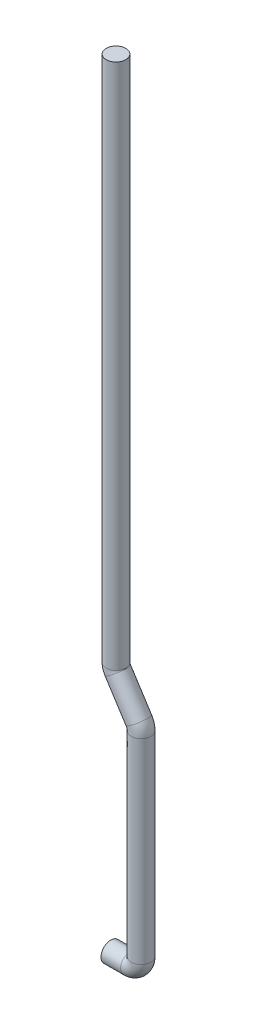
ISO-10303-21;
HEADER;
FILE_DESCRIPTION(('STEP AP214'),'2;1');
FILE_NAME('part.step','',(''),(''),'','','');
FILE_SCHEMA(('AUTOMOTIVE_DESIGN { 1 0 10303 214 1 1 1 1 }'));
ENDSEC;
DATA;
#1=APPLICATION_CONTEXT('core data for automotive mechanical design processes');
#2=APPLICATION_PROTOCOL_DEFINITION('international standard','automotive_design',2000,#1);
#3=PRODUCT_CONTEXT('',#1,'mechanical');
#4=PRODUCT('Part','Part','',(#3));
#5=PRODUCT_RELATED_PRODUCT_CATEGORY('part','',(#4));
#6=PRODUCT_DEFINITION_FORMATION('','',#4);
#7=PRODUCT_DEFINITION_CONTEXT('part definition',#1,'design');
#8=PRODUCT_DEFINITION('design','',#6,#7);
#9=PRODUCT_DEFINITION_SHAPE('','',#8);
#10=(LENGTH_UNIT() NAMED_UNIT(*) SI_UNIT(.MILLI.,.METRE.));
#11=(NAMED_UNIT(*) PLANE_ANGLE_UNIT() SI_UNIT($,.RADIAN.));
#12=(NAMED_UNIT(*) SI_UNIT($,.STERADIAN.) SOLID_ANGLE_UNIT());
#13=UNCERTAINTY_MEASURE_WITH_UNIT(LENGTH_MEASURE(1.E-05),#10,'distance_accuracy_value','');
#14=(GEOMETRIC_REPRESENTATION_CONTEXT(3) GLOBAL_UNCERTAINTY_ASSIGNED_CONTEXT((#13)) GLOBAL_UNIT_ASSIGNED_CONTEXT((#10,
#11,#12)) REPRESENTATION_CONTEXT('',''));
#15=CARTESIAN_POINT('',(0.,0.,0.));
#16=DIRECTION('',(0.,0.,1.));
#17=DIRECTION('',(1.,0.,0.));
#18=AXIS2_PLACEMENT_3D('',#15,#16,#17);
#19=CARTESIAN_POINT('',(2.11214781096203,317.721722854031,0.));
#20=DIRECTION('',(0.,1.,0.));
#21=DIRECTION('',(0.,0.,-1.));
#22=AXIS2_PLACEMENT_3D('',#19,#20,#21);
#23=PLANE('',#22);
#24=CARTESIAN_POINT('',(2.11214781096203,317.721722854031,0.));
#25=DIRECTION('',(0.,1.,0.));
#26=DIRECTION('',(0.,0.,-1.));
#27=AXIS2_PLACEMENT_3D('',#24,#25,#26);
#28=CIRCLE('',#27,4.);
#29=CARTESIAN_POINT('',(2.11214781096203,317.721722854031,-4.));
#30=VERTEX_POINT('',#29);
#31=EDGE_CURVE('E82',#30,#30,#28,.T.);
#32=ORIENTED_EDGE('',*,*,#31,.T.);
#33=EDGE_LOOP('',(#32));
#34=FACE_BOUND('',#33,.T.);
#35=ADVANCED_FACE('F47',(#34),#23,.T.);
#36=CARTESIAN_POINT('',(0.,0.,0.));
#37=DIRECTION('',(1.,0.,0.));
#38=DIRECTION('',(0.,0.,-1.));
#39=AXIS2_PLACEMENT_3D('',#36,#37,#38);
#40=PLANE('',#39);
#41=CARTESIAN_POINT('',(0.,0.,0.));
#42=DIRECTION('',(1.,0.,0.));
#43=DIRECTION('',(0.,0.,-1.));
#44=AXIS2_PLACEMENT_3D('',#41,#42,#43);
#45=CIRCLE('',#44,4.);
#46=CARTESIAN_POINT('',(0.,0.,-4.));
#47=VERTEX_POINT('',#46);
#48=EDGE_CURVE('E12',#47,#47,#45,.T.);
#49=ORIENTED_EDGE('',*,*,#48,.F.);
#50=EDGE_LOOP('',(#49));
#51=FACE_BOUND('',#50,.T.);
#52=ADVANCED_FACE('F91',(#51),#40,.F.);
#53=CARTESIAN_POINT('',(2.11214781096203,317.721722854031,0.));
#54=DIRECTION('',(0.,-1.,0.));
#55=DIRECTION('',(1.,0.,0.));
#56=AXIS2_PLACEMENT_3D('',#53,#54,#55);
#57=CYLINDRICAL_SURFACE('',#56,4.);
#58=CARTESIAN_POINT('',(2.11214781096205,103.015358085818,0.));
#59=DIRECTION('',(0.,1.,0.));
#60=DIRECTION('',(0.,0.,-1.));
#61=AXIS2_PLACEMENT_3D('',#58,#59,#60);
#62=CIRCLE('',#61,4.);
#63=CARTESIAN_POINT('',(-1.88785218903794,103.015358085818,0.));
#64=VERTEX_POINT('',#63);
#65=EDGE_CURVE('E78',#64,#64,#62,.T.);
#66=ORIENTED_EDGE('',*,*,#65,.T.);
#67=EDGE_LOOP('',(#66));
#68=FACE_BOUND('',#67,.T.);
#69=ORIENTED_EDGE('',*,*,#31,.F.);
#70=EDGE_LOOP('',(#69));
#71=FACE_BOUND('',#70,.T.);
#72=ADVANCED_FACE('F88',(#68,#71),#57,.T.);
#73=CARTESIAN_POINT('',(6.46266725096206,103.015358085818,0.));
#74=DIRECTION('',(0.,0.,1.));
#75=DIRECTION('',(1.,0.,0.));
#76=AXIS2_PLACEMENT_3D('',#73,#74,#75);
#77=TOROIDAL_SURFACE('',#76,4.35051944,4.);
#78=CARTESIAN_POINT('',(2.80307598330831,100.6628251633,0.));
#79=DIRECTION('',(-0.540747594617767,0.841184901739861,0.));
#80=DIRECTION('',(0.,0.,-1.));
#81=AXIS2_PLACEMENT_3D('',#78,#79,#80);
#82=CIRCLE('',#81,4.);
#83=CARTESIAN_POINT('',(-0.561663623651139,98.4998347848288,0.));
#84=VERTEX_POINT('',#83);
#85=EDGE_CURVE('E74',#84,#84,#82,.T.);
#86=CARTESIAN_POINT('',(6.46266725096206,103.015358085818,0.));
#87=DIRECTION('',(0.,0.,1.));
#88=DIRECTION('',(1.,0.,0.));
#89=AXIS2_PLACEMENT_3D('',#86,#87,#88);
#90=CIRCLE('',#89,8.35051944);
#91=EDGE_CURVE('',#64,#84,#90,.T.);
#92=ORIENTED_EDGE('',*,*,#65,.F.);
#93=ORIENTED_EDGE('',*,*,#85,.T.);
#94=ORIENTED_EDGE('',*,*,#91,.T.);
#95=ORIENTED_EDGE('',*,*,#91,.F.);
#96=EDGE_LOOP('',(#92,#94,#93,#95));
#97=FACE_BOUND('',#96,.T.);
#98=ADVANCED_FACE('F90',(#97),#77,.T.);
#99=CARTESIAN_POINT('',(2.80307598330831,100.6628251633,0.));
#100=DIRECTION('',(0.540747594617768,-0.84118490173986,0.));
#101=DIRECTION('',(0.84118490173986,0.540747594617768,0.));
#102=AXIS2_PLACEMENT_3D('',#99,#100,#101);
#103=CYLINDRICAL_SURFACE('',#102,4.);
#104=CARTESIAN_POINT('',(11.3883564338094,87.3075955440749,0.));
#105=DIRECTION('',(-0.540747594617768,0.84118490173986,0.));
#106=DIRECTION('',(0.,0.,-1.));
#107=AXIS2_PLACEMENT_3D('',#104,#105,#106);
#108=CIRCLE('',#107,4.);
#109=CARTESIAN_POINT('',(14.7530960407688,89.470585922546,0.));
#110=VERTEX_POINT('',#109);
#111=EDGE_CURVE('E70',#110,#110,#108,.T.);
#112=ORIENTED_EDGE('',*,*,#111,.T.);
#113=EDGE_LOOP('',(#112));
#114=FACE_BOUND('',#113,.T.);
#115=ORIENTED_EDGE('',*,*,#85,.F.);
#116=EDGE_LOOP('',(#115));
#117=FACE_BOUND('',#116,.T.);
#118=ADVANCED_FACE('F98',(#114,#117),#103,.T.);
#119=CARTESIAN_POINT('',(6.29213446549112,84.0315384425905,0.));
#120=DIRECTION('',(0.,0.,-1.));
#121=DIRECTION('',(-1.,0.,0.));
#122=AXIS2_PLACEMENT_3D('',#119,#120,#121);
#123=TOROIDAL_SURFACE('',#122,6.05838497312246,4.);
#124=CARTESIAN_POINT('',(12.3505194386136,84.0315384425905,0.));
#125=DIRECTION('',(0.,1.,0.));
#126=DIRECTION('',(0.,0.,-1.));
#127=AXIS2_PLACEMENT_3D('',#124,#125,#126);
#128=CIRCLE('',#127,4.);
#129=CARTESIAN_POINT('',(16.3505194386136,84.0315384425905,0.));
#130=VERTEX_POINT('',#129);
#131=EDGE_CURVE('E64',#130,#130,#128,.T.);
#132=CARTESIAN_POINT('',(6.29213446549112,84.0315384425905,0.));
#133=DIRECTION('',(0.,0.,-1.));
#134=DIRECTION('',(-1.,0.,0.));
#135=AXIS2_PLACEMENT_3D('',#132,#133,#134);
#136=CIRCLE('',#135,10.0583849731225);
#137=EDGE_CURVE('',#110,#130,#136,.T.);
#138=ORIENTED_EDGE('',*,*,#111,.F.);
#139=ORIENTED_EDGE('',*,*,#131,.T.);
#140=ORIENTED_EDGE('',*,*,#137,.T.);
#141=ORIENTED_EDGE('',*,*,#137,.F.);
#142=EDGE_LOOP('',(#138,#140,#139,#141));
#143=FACE_BOUND('',#142,.T.);
#144=ADVANCED_FACE('F115',(#143),#123,.T.);
#145=CARTESIAN_POINT('',(12.3505194386136,84.0315384425905,0.));
#146=DIRECTION('',(0.,-1.,0.));
#147=DIRECTION('',(1.,0.,0.));
#148=AXIS2_PLACEMENT_3D('',#145,#146,#147);
#149=CYLINDRICAL_SURFACE('',#148,4.);
#150=CARTESIAN_POINT('',(12.3505194386136,4.35051943861358,0.));
#151=DIRECTION('',(0.,1.,0.));
#152=DIRECTION('',(0.,0.,-1.));
#153=AXIS2_PLACEMENT_3D('',#150,#151,#152);
#154=CIRCLE('',#153,4.);
#155=CARTESIAN_POINT('',(16.3505194386136,4.35051943861358,0.));
#156=VERTEX_POINT('',#155);
#157=EDGE_CURVE('E59',#156,#156,#154,.T.);
#158=ORIENTED_EDGE('',*,*,#157,.T.);
#159=EDGE_LOOP('',(#158));
#160=FACE_BOUND('',#159,.T.);
#161=ORIENTED_EDGE('',*,*,#131,.F.);
#162=EDGE_LOOP('',(#161));
#163=FACE_BOUND('',#162,.T.);
#164=ADVANCED_FACE('F109',(#160,#163),#149,.T.);
#165=CARTESIAN_POINT('',(8.,4.35051943861358,0.));
#166=DIRECTION('',(0.,0.,-1.));
#167=DIRECTION('',(-1.,0.,0.));
#168=AXIS2_PLACEMENT_3D('',#165,#166,#167);
#169=TOROIDAL_SURFACE('',#168,4.35051943861358,4.);
#170=CARTESIAN_POINT('',(8.,0.,0.));
#171=DIRECTION('',(1.,0.,0.));
#172=DIRECTION('',(0.,0.,-1.));
#173=AXIS2_PLACEMENT_3D('',#170,#171,#172);
#174=CIRCLE('',#173,4.);
#175=CARTESIAN_POINT('',(8.,-4.,0.));
#176=VERTEX_POINT('',#175);
#177=EDGE_CURVE('E54',#176,#176,#174,.T.);
#178=CARTESIAN_POINT('',(8.,4.35051943861358,0.));
#179=DIRECTION('',(0.,0.,-1.));
#180=DIRECTION('',(-1.,0.,0.));
#181=AXIS2_PLACEMENT_3D('',#178,#179,#180);
#182=CIRCLE('',#181,8.35051943861358);
#183=EDGE_CURVE('',#156,#176,#182,.T.);
#184=ORIENTED_EDGE('',*,*,#157,.F.);
#185=ORIENTED_EDGE('',*,*,#177,.T.);
#186=ORIENTED_EDGE('',*,*,#183,.T.);
#187=ORIENTED_EDGE('',*,*,#183,.F.);
#188=EDGE_LOOP('',(#184,#186,#185,#187));
#189=FACE_BOUND('',#188,.T.);
#190=ADVANCED_FACE('F104',(#189),#169,.T.);
#191=CARTESIAN_POINT('',(8.,0.,0.));
#192=DIRECTION('',(-1.,0.,0.));
#193=DIRECTION('',(0.,0.,1.));
#194=AXIS2_PLACEMENT_3D('',#191,#192,#193);
#195=CYLINDRICAL_SURFACE('',#194,4.);
#196=ORIENTED_EDGE('',*,*,#48,.T.);
#197=EDGE_LOOP('',(#196));
#198=FACE_BOUND('',#197,.T.);
#199=ORIENTED_EDGE('',*,*,#177,.F.);
#200=EDGE_LOOP('',(#199));
#201=FACE_BOUND('',#200,.T.);
#202=ADVANCED_FACE('F102',(#198,#201),#195,.T.);
#203=CLOSED_SHELL('',(#35,#52,#72,#98,#118,#144,#164,#190,#202));
#204=MANIFOLD_SOLID_BREP('B2',#203);
#205=ADVANCED_BREP_SHAPE_REPRESENTATION('',(#18,#204),#14);
#206=SHAPE_DEFINITION_REPRESENTATION(#9,#205);
ENDSEC;
END-ISO-10303-21;
